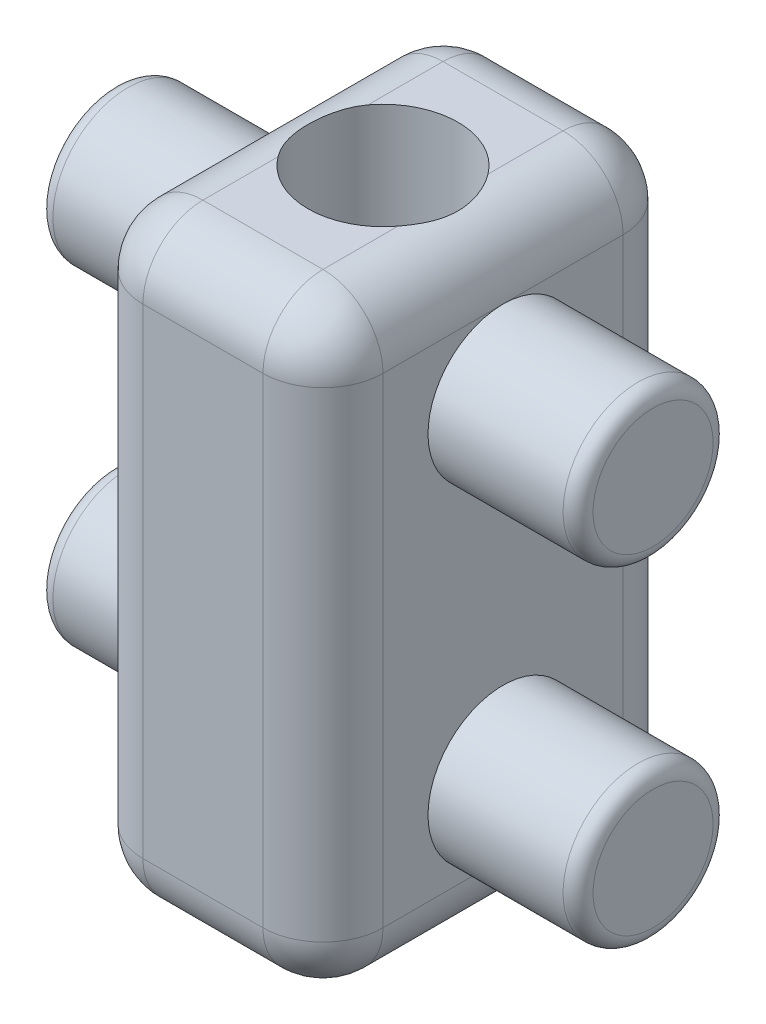
ISO-10303-21;
HEADER;
FILE_DESCRIPTION(('STEP AP214'),'2;1');
FILE_NAME('part.step','',(''),(''),'','','');
FILE_SCHEMA(('AUTOMOTIVE_DESIGN { 1 0 10303 214 1 1 1 1 }'));
ENDSEC;
DATA;
#1=APPLICATION_CONTEXT('core data for automotive mechanical design processes');
#2=APPLICATION_PROTOCOL_DEFINITION('international standard','automotive_design',2000,#1);
#3=PRODUCT_CONTEXT('',#1,'mechanical');
#4=PRODUCT('Part','Part','',(#3));
#5=PRODUCT_RELATED_PRODUCT_CATEGORY('part','',(#4));
#6=PRODUCT_DEFINITION_FORMATION('','',#4);
#7=PRODUCT_DEFINITION_CONTEXT('part definition',#1,'design');
#8=PRODUCT_DEFINITION('design','',#6,#7);
#9=PRODUCT_DEFINITION_SHAPE('','',#8);
#10=(LENGTH_UNIT() NAMED_UNIT(*) SI_UNIT(.MILLI.,.METRE.));
#11=(NAMED_UNIT(*) PLANE_ANGLE_UNIT() SI_UNIT($,.RADIAN.));
#12=(NAMED_UNIT(*) SI_UNIT($,.STERADIAN.) SOLID_ANGLE_UNIT());
#13=UNCERTAINTY_MEASURE_WITH_UNIT(LENGTH_MEASURE(1.E-05),#10,'distance_accuracy_value','');
#14=(GEOMETRIC_REPRESENTATION_CONTEXT(3) GLOBAL_UNCERTAINTY_ASSIGNED_CONTEXT((#13)) GLOBAL_UNIT_ASSIGNED_CONTEXT((#10,
#11,#12)) REPRESENTATION_CONTEXT('',''));
#15=CARTESIAN_POINT('',(0.,0.,0.));
#16=DIRECTION('',(0.,0.,1.));
#17=DIRECTION('',(1.,0.,0.));
#18=AXIS2_PLACEMENT_3D('',#15,#16,#17);
#19=CARTESIAN_POINT('',(-11.43,12.7,-12.7));
#20=DIRECTION('',(0.,-1.,0.));
#21=DIRECTION('',(0.,0.,-1.));
#22=AXIS2_PLACEMENT_3D('',#19,#20,#21);
#23=PLANE('',#22);
#24=DIRECTION('',(0.,0.,1.));
#25=VECTOR('',#24,1.);
#26=CARTESIAN_POINT('',(2.54,12.7,7.62));
#27=LINE('',#26,#25);
#28=CARTESIAN_POINT('',(2.54,12.7,5.08));
#29=VERTEX_POINT('',#28);
#30=CARTESIAN_POINT('',(2.54,12.7,1.905));
#31=VERTEX_POINT('',#30);
#32=EDGE_CURVE('E156',#29,#31,#27,.F.);
#33=ORIENTED_EDGE('',*,*,#32,.T.);
#34=CARTESIAN_POINT('',(0.,12.7,0.));
#35=DIRECTION('',(0.,-1.,0.));
#36=DIRECTION('',(0.,0.,-1.));
#37=AXIS2_PLACEMENT_3D('',#34,#35,#36);
#38=CIRCLE('',#37,3.175);
#39=CARTESIAN_POINT('',(-2.54,12.7,1.905));
#40=VERTEX_POINT('',#39);
#41=EDGE_CURVE('E11',#31,#40,#38,.T.);
#42=ORIENTED_EDGE('',*,*,#41,.T.);
#43=DIRECTION('',(0.,0.,1.));
#44=VECTOR('',#43,1.);
#45=CARTESIAN_POINT('',(-2.54,12.7,7.62));
#46=LINE('',#45,#44);
#47=CARTESIAN_POINT('',(-2.54,12.7,5.08));
#48=VERTEX_POINT('',#47);
#49=EDGE_CURVE('E172',#40,#48,#46,.T.);
#50=ORIENTED_EDGE('',*,*,#49,.T.);
#51=DIRECTION('',(-1.,0.,0.));
#52=VECTOR('',#51,1.);
#53=CARTESIAN_POINT('',(5.08,12.7,5.08));
#54=LINE('',#53,#52);
#55=EDGE_CURVE('E162',#48,#29,#54,.F.);
#56=ORIENTED_EDGE('',*,*,#55,.T.);
#57=EDGE_LOOP('',(#33,#42,#50,#56));
#58=FACE_BOUND('',#57,.T.);
#59=ADVANCED_FACE('F34',(#58),#23,.F.);
#60=CARTESIAN_POINT('',(5.08,0.,0.));
#61=DIRECTION('',(-1.,0.,0.));
#62=DIRECTION('',(0.,0.,1.));
#63=AXIS2_PLACEMENT_3D('',#60,#61,#62);
#64=PLANE('',#63);
#65=DIRECTION('',(0.,0.,-1.));
#66=VECTOR('',#65,1.);
#67=CARTESIAN_POINT('',(5.08,-10.16,0.));
#68=LINE('',#67,#66);
#69=CARTESIAN_POINT('',(5.08,-10.16,5.08));
#70=VERTEX_POINT('',#69);
#71=CARTESIAN_POINT('',(5.08,-10.16,0.));
#72=VERTEX_POINT('',#71);
#73=EDGE_CURVE('E202',#70,#72,#68,.T.);
#74=ORIENTED_EDGE('',*,*,#73,.T.);
#75=CARTESIAN_POINT('',(5.08,-6.985,0.));
#76=DIRECTION('',(1.,0.,0.));
#77=DIRECTION('',(0.,0.,-1.));
#78=AXIS2_PLACEMENT_3D('',#75,#76,#77);
#79=CIRCLE('',#78,3.175);
#80=EDGE_CURVE('E754',#72,#72,#79,.T.);
#81=ORIENTED_EDGE('',*,*,#80,.F.);
#82=CARTESIAN_POINT('',(5.08,-10.16,-5.08));
#83=VERTEX_POINT('',#82);
#84=EDGE_CURVE('E201',#72,#83,#68,.T.);
#85=ORIENTED_EDGE('',*,*,#84,.T.);
#86=DIRECTION('',(0.,1.,0.));
#87=VECTOR('',#86,1.);
#88=CARTESIAN_POINT('',(5.08,0.,-5.08));
#89=LINE('',#88,#87);
#90=CARTESIAN_POINT('',(5.08,10.16,-5.08));
#91=VERTEX_POINT('',#90);
#92=EDGE_CURVE('E195',#83,#91,#89,.T.);
#93=ORIENTED_EDGE('',*,*,#92,.T.);
#94=DIRECTION('',(0.,0.,1.));
#95=VECTOR('',#94,1.);
#96=CARTESIAN_POINT('',(5.08,10.16,0.));
#97=LINE('',#96,#95);
#98=CARTESIAN_POINT('',(5.08,10.16,0.));
#99=VERTEX_POINT('',#98);
#100=EDGE_CURVE('E198',#91,#99,#97,.T.);
#101=ORIENTED_EDGE('',*,*,#100,.T.);
#102=CARTESIAN_POINT('',(5.08,6.985,0.));
#103=DIRECTION('',(1.,0.,0.));
#104=DIRECTION('',(0.,0.,-1.));
#105=AXIS2_PLACEMENT_3D('',#102,#103,#104);
#106=CIRCLE('',#105,3.175);
#107=EDGE_CURVE('E208',#99,#99,#106,.T.);
#108=ORIENTED_EDGE('',*,*,#107,.F.);
#109=CARTESIAN_POINT('',(5.08,10.16,5.08));
#110=VERTEX_POINT('',#109);
#111=EDGE_CURVE('E197',#99,#110,#97,.T.);
#112=ORIENTED_EDGE('',*,*,#111,.T.);
#113=DIRECTION('',(0.,-1.,0.));
#114=VECTOR('',#113,1.);
#115=CARTESIAN_POINT('',(5.08,0.,5.08));
#116=LINE('',#115,#114);
#117=EDGE_CURVE('E57',#110,#70,#116,.T.);
#118=ORIENTED_EDGE('',*,*,#117,.T.);
#119=EDGE_LOOP('',(#74,#81,#85,#93,#101,#108,#112,#118));
#120=FACE_BOUND('',#119,.T.);
#121=ADVANCED_FACE('F364',(#120),#64,.F.);
#122=CARTESIAN_POINT('',(5.08,-12.7,-7.62));
#123=DIRECTION('',(0.,0.,1.));
#124=DIRECTION('',(1.,0.,0.));
#125=AXIS2_PLACEMENT_3D('',#122,#123,#124);
#126=PLANE('',#125);
#127=DIRECTION('',(-1.,0.,0.));
#128=VECTOR('',#127,1.);
#129=CARTESIAN_POINT('',(5.08,-10.16,-7.62));
#130=LINE('',#129,#128);
#131=CARTESIAN_POINT('',(2.54,-10.16,-7.62));
#132=VERTEX_POINT('',#131);
#133=CARTESIAN_POINT('',(-2.54,-10.16,-7.62));
#134=VERTEX_POINT('',#133);
#135=EDGE_CURVE('E764',#132,#134,#130,.T.);
#136=ORIENTED_EDGE('',*,*,#135,.T.);
#137=DIRECTION('',(0.,1.,0.));
#138=VECTOR('',#137,1.);
#139=CARTESIAN_POINT('',(-2.54,12.7,-7.62));
#140=LINE('',#139,#138);
#141=CARTESIAN_POINT('',(-2.54,10.16,-7.62));
#142=VERTEX_POINT('',#141);
#143=EDGE_CURVE('E767',#134,#142,#140,.T.);
#144=ORIENTED_EDGE('',*,*,#143,.T.);
#145=DIRECTION('',(-1.,0.,0.));
#146=VECTOR('',#145,1.);
#147=CARTESIAN_POINT('',(5.08,10.16,-7.62));
#148=LINE('',#147,#146);
#149=CARTESIAN_POINT('',(2.54,10.16,-7.62));
#150=VERTEX_POINT('',#149);
#151=EDGE_CURVE('E762',#142,#150,#148,.F.);
#152=ORIENTED_EDGE('',*,*,#151,.T.);
#153=DIRECTION('',(0.,1.,0.));
#154=VECTOR('',#153,1.);
#155=CARTESIAN_POINT('',(2.54,-12.7,-7.62));
#156=LINE('',#155,#154);
#157=EDGE_CURVE('E275',#150,#132,#156,.F.);
#158=ORIENTED_EDGE('',*,*,#157,.T.);
#159=EDGE_LOOP('',(#136,#144,#152,#158));
#160=FACE_BOUND('',#159,.T.);
#161=ADVANCED_FACE('F367',(#160),#126,.F.);
#162=CARTESIAN_POINT('',(5.08,-12.7,7.62));
#163=DIRECTION('',(0.,0.,-1.));
#164=DIRECTION('',(-1.,0.,0.));
#165=AXIS2_PLACEMENT_3D('',#162,#163,#164);
#166=PLANE('',#165);
#167=DIRECTION('',(-1.,0.,0.));
#168=VECTOR('',#167,1.);
#169=CARTESIAN_POINT('',(5.08,10.16,7.62));
#170=LINE('',#169,#168);
#171=CARTESIAN_POINT('',(2.54,10.16,7.62));
#172=VERTEX_POINT('',#171);
#173=CARTESIAN_POINT('',(-2.54,10.16,7.62));
#174=VERTEX_POINT('',#173);
#175=EDGE_CURVE('E180',#172,#174,#170,.T.);
#176=ORIENTED_EDGE('',*,*,#175,.T.);
#177=DIRECTION('',(0.,-1.,0.));
#178=VECTOR('',#177,1.);
#179=CARTESIAN_POINT('',(-2.54,-12.7,7.62));
#180=LINE('',#179,#178);
#181=CARTESIAN_POINT('',(-2.54,-10.16,7.62));
#182=VERTEX_POINT('',#181);
#183=EDGE_CURVE('E183',#174,#182,#180,.T.);
#184=ORIENTED_EDGE('',*,*,#183,.T.);
#185=DIRECTION('',(-1.,0.,0.));
#186=VECTOR('',#185,1.);
#187=CARTESIAN_POINT('',(5.08,-10.16,7.62));
#188=LINE('',#187,#186);
#189=CARTESIAN_POINT('',(2.54,-10.16,7.62));
#190=VERTEX_POINT('',#189);
#191=EDGE_CURVE('E178',#182,#190,#188,.F.);
#192=ORIENTED_EDGE('',*,*,#191,.T.);
#193=DIRECTION('',(0.,-1.,0.));
#194=VECTOR('',#193,1.);
#195=CARTESIAN_POINT('',(2.54,-12.7,7.62));
#196=LINE('',#195,#194);
#197=EDGE_CURVE('E176',#190,#172,#196,.F.);
#198=ORIENTED_EDGE('',*,*,#197,.T.);
#199=EDGE_LOOP('',(#176,#184,#192,#198));
#200=FACE_BOUND('',#199,.T.);
#201=ADVANCED_FACE('F376',(#200),#166,.F.);
#202=CARTESIAN_POINT('',(5.08,-12.7,7.62));
#203=DIRECTION('',(0.,1.,0.));
#204=DIRECTION('',(0.,0.,1.));
#205=AXIS2_PLACEMENT_3D('',#202,#203,#204);
#206=PLANE('',#205);
#207=DIRECTION('',(-1.,0.,0.));
#208=VECTOR('',#207,1.);
#209=CARTESIAN_POINT('',(5.08,-12.7,5.08));
#210=LINE('',#209,#208);
#211=CARTESIAN_POINT('',(2.54,-12.7,5.08));
#212=VERTEX_POINT('',#211);
#213=CARTESIAN_POINT('',(-2.54,-12.7,5.08));
#214=VERTEX_POINT('',#213);
#215=EDGE_CURVE('E771',#212,#214,#210,.T.);
#216=ORIENTED_EDGE('',*,*,#215,.T.);
#217=DIRECTION('',(0.,0.,-1.));
#218=VECTOR('',#217,1.);
#219=CARTESIAN_POINT('',(-2.54,-12.7,-7.62));
#220=LINE('',#219,#218);
#221=CARTESIAN_POINT('',(-2.54,-12.7,-5.08));
#222=VERTEX_POINT('',#221);
#223=EDGE_CURVE('E167',#214,#222,#220,.T.);
#224=ORIENTED_EDGE('',*,*,#223,.T.);
#225=DIRECTION('',(-1.,0.,0.));
#226=VECTOR('',#225,1.);
#227=CARTESIAN_POINT('',(5.08,-12.7,-5.08));
#228=LINE('',#227,#226);
#229=CARTESIAN_POINT('',(2.54,-12.7,-5.08));
#230=VERTEX_POINT('',#229);
#231=EDGE_CURVE('E772',#222,#230,#228,.F.);
#232=ORIENTED_EDGE('',*,*,#231,.T.);
#233=DIRECTION('',(0.,0.,-1.));
#234=VECTOR('',#233,1.);
#235=CARTESIAN_POINT('',(2.54,-12.7,7.62));
#236=LINE('',#235,#234);
#237=EDGE_CURVE('E769',#230,#212,#236,.F.);
#238=ORIENTED_EDGE('',*,*,#237,.T.);
#239=EDGE_LOOP('',(#216,#224,#232,#238));
#240=FACE_BOUND('',#239,.T.);
#241=ADVANCED_FACE('F372',(#240),#206,.F.);
#242=CARTESIAN_POINT('',(-5.08,0.,0.));
#243=DIRECTION('',(-1.,0.,0.));
#244=DIRECTION('',(0.,0.,1.));
#245=AXIS2_PLACEMENT_3D('',#242,#243,#244);
#246=PLANE('',#245);
#247=DIRECTION('',(0.,0.,-1.));
#248=VECTOR('',#247,1.);
#249=CARTESIAN_POINT('',(-5.08,-10.16,7.62));
#250=LINE('',#249,#248);
#251=CARTESIAN_POINT('',(-5.08,-10.16,-5.08));
#252=VERTEX_POINT('',#251);
#253=CARTESIAN_POINT('',(-5.08,-10.16,0.));
#254=VERTEX_POINT('',#253);
#255=EDGE_CURVE('E188',#252,#254,#250,.F.);
#256=ORIENTED_EDGE('',*,*,#255,.T.);
#257=CARTESIAN_POINT('',(-5.08,-6.985,0.));
#258=DIRECTION('',(1.,0.,0.));
#259=DIRECTION('',(0.,0.,-1.));
#260=AXIS2_PLACEMENT_3D('',#257,#258,#259);
#261=CIRCLE('',#260,3.175);
#262=EDGE_CURVE('E159',#254,#254,#261,.T.);
#263=ORIENTED_EDGE('',*,*,#262,.T.);
#264=CARTESIAN_POINT('',(-5.08,-10.16,5.08));
#265=VERTEX_POINT('',#264);
#266=EDGE_CURVE('E187',#254,#265,#250,.F.);
#267=ORIENTED_EDGE('',*,*,#266,.T.);
#268=DIRECTION('',(0.,-1.,0.));
#269=VECTOR('',#268,1.);
#270=CARTESIAN_POINT('',(-5.08,12.7,5.08));
#271=LINE('',#270,#269);
#272=CARTESIAN_POINT('',(-5.08,10.16,5.08));
#273=VERTEX_POINT('',#272);
#274=EDGE_CURVE('E190',#265,#273,#271,.F.);
#275=ORIENTED_EDGE('',*,*,#274,.T.);
#276=DIRECTION('',(0.,0.,1.));
#277=VECTOR('',#276,1.);
#278=CARTESIAN_POINT('',(-5.08,10.16,-7.62));
#279=LINE('',#278,#277);
#280=CARTESIAN_POINT('',(-5.08,10.16,0.));
#281=VERTEX_POINT('',#280);
#282=EDGE_CURVE('E193',#273,#281,#279,.F.);
#283=ORIENTED_EDGE('',*,*,#282,.T.);
#284=CARTESIAN_POINT('',(-5.08,6.985,0.));
#285=DIRECTION('',(1.,0.,0.));
#286=DIRECTION('',(0.,0.,-1.));
#287=AXIS2_PLACEMENT_3D('',#284,#285,#286);
#288=CIRCLE('',#287,3.175);
#289=EDGE_CURVE('E752',#281,#281,#288,.T.);
#290=ORIENTED_EDGE('',*,*,#289,.T.);
#291=CARTESIAN_POINT('',(-5.08,10.16,-5.08));
#292=VERTEX_POINT('',#291);
#293=EDGE_CURVE('E192',#281,#292,#279,.F.);
#294=ORIENTED_EDGE('',*,*,#293,.T.);
#295=DIRECTION('',(0.,1.,0.));
#296=VECTOR('',#295,1.);
#297=CARTESIAN_POINT('',(-5.08,-12.7,-5.08));
#298=LINE('',#297,#296);
#299=EDGE_CURVE('E185',#292,#252,#298,.F.);
#300=ORIENTED_EDGE('',*,*,#299,.T.);
#301=EDGE_LOOP('',(#256,#263,#267,#275,#283,#290,#294,#300));
#302=FACE_BOUND('',#301,.T.);
#303=ADVANCED_FACE('F368',(#302),#246,.T.);
#304=CARTESIAN_POINT('',(5.08,10.16,5.08));
#305=DIRECTION('',(-1.,0.,0.));
#306=DIRECTION('',(0.,0.,1.));
#307=AXIS2_PLACEMENT_3D('',#304,#305,#306);
#308=CYLINDRICAL_SURFACE('',#307,2.54);
#309=CARTESIAN_POINT('',(2.54,10.16,5.08));
#310=DIRECTION('',(1.,0.,0.));
#311=DIRECTION('',(0.,0.,-1.));
#312=AXIS2_PLACEMENT_3D('',#309,#310,#311);
#313=CIRCLE('',#312,2.54);
#314=EDGE_CURVE('E272',#29,#172,#313,.T.);
#315=ORIENTED_EDGE('',*,*,#314,.F.);
#316=ORIENTED_EDGE('',*,*,#55,.F.);
#317=CARTESIAN_POINT('',(-2.54,10.16,5.08));
#318=DIRECTION('',(-1.,0.,0.));
#319=DIRECTION('',(0.,0.,1.));
#320=AXIS2_PLACEMENT_3D('',#317,#318,#319);
#321=CIRCLE('',#320,2.54);
#322=EDGE_CURVE('E269',#174,#48,#321,.T.);
#323=ORIENTED_EDGE('',*,*,#322,.F.);
#324=ORIENTED_EDGE('',*,*,#175,.F.);
#325=EDGE_LOOP('',(#315,#316,#323,#324));
#326=FACE_BOUND('',#325,.T.);
#327=ADVANCED_FACE('F371',(#326),#308,.T.);
#328=CARTESIAN_POINT('',(2.54,10.16,5.08));
#329=DIRECTION('',(0.,0.,1.));
#330=DIRECTION('',(1.,0.,0.));
#331=AXIS2_PLACEMENT_3D('',#328,#329,#330);
#332=SPHERICAL_SURFACE('',#331,2.54);
#333=CARTESIAN_POINT('',(2.54,10.16,5.08));
#334=DIRECTION('',(0.,0.,1.));
#335=DIRECTION('',(1.,0.,0.));
#336=AXIS2_PLACEMENT_3D('',#333,#334,#335);
#337=CIRCLE('',#336,2.54);
#338=EDGE_CURVE('E264',#29,#110,#337,.F.);
#339=ORIENTED_EDGE('',*,*,#338,.F.);
#340=ORIENTED_EDGE('',*,*,#314,.T.);
#341=CARTESIAN_POINT('',(2.54,10.16,5.08));
#342=DIRECTION('',(0.,1.,0.));
#343=DIRECTION('',(0.,0.,1.));
#344=AXIS2_PLACEMENT_3D('',#341,#342,#343);
#345=CIRCLE('',#344,2.54);
#346=EDGE_CURVE('E266',#110,#172,#345,.F.);
#347=ORIENTED_EDGE('',*,*,#346,.F.);
#348=EDGE_LOOP('',(#339,#340,#347));
#349=FACE_BOUND('',#348,.T.);
#350=ADVANCED_FACE('F469',(#349),#332,.T.);
#351=CARTESIAN_POINT('',(-2.54,10.16,5.08));
#352=DIRECTION('',(0.,0.,1.));
#353=DIRECTION('',(1.,0.,0.));
#354=AXIS2_PLACEMENT_3D('',#351,#352,#353);
#355=SPHERICAL_SURFACE('',#354,2.54);
#356=CARTESIAN_POINT('',(-2.54,10.16,5.08));
#357=DIRECTION('',(0.,1.,0.));
#358=DIRECTION('',(0.,0.,1.));
#359=AXIS2_PLACEMENT_3D('',#356,#357,#358);
#360=CIRCLE('',#359,2.54);
#361=EDGE_CURVE('E258',#174,#273,#360,.F.);
#362=ORIENTED_EDGE('',*,*,#361,.F.);
#363=ORIENTED_EDGE('',*,*,#322,.T.);
#364=CARTESIAN_POINT('',(-2.54,10.16,5.08));
#365=DIRECTION('',(0.,0.,1.));
#366=DIRECTION('',(1.,0.,0.));
#367=AXIS2_PLACEMENT_3D('',#364,#365,#366);
#368=CIRCLE('',#367,2.54);
#369=EDGE_CURVE('E261',#273,#48,#368,.F.);
#370=ORIENTED_EDGE('',*,*,#369,.F.);
#371=EDGE_LOOP('',(#362,#363,#370));
#372=FACE_BOUND('',#371,.T.);
#373=ADVANCED_FACE('F478',(#372),#355,.T.);
#374=CARTESIAN_POINT('',(2.54,0.,5.08));
#375=DIRECTION('',(0.,-1.,0.));
#376=DIRECTION('',(0.,0.,-1.));
#377=AXIS2_PLACEMENT_3D('',#374,#375,#376);
#378=CYLINDRICAL_SURFACE('',#377,2.54);
#379=ORIENTED_EDGE('',*,*,#346,.T.);
#380=ORIENTED_EDGE('',*,*,#197,.F.);
#381=CARTESIAN_POINT('',(2.54,-10.16,5.08));
#382=DIRECTION('',(0.,-1.,0.));
#383=DIRECTION('',(0.,0.,-1.));
#384=AXIS2_PLACEMENT_3D('',#381,#382,#383);
#385=CIRCLE('',#384,2.54);
#386=EDGE_CURVE('E252',#70,#190,#385,.T.);
#387=ORIENTED_EDGE('',*,*,#386,.F.);
#388=ORIENTED_EDGE('',*,*,#117,.F.);
#389=EDGE_LOOP('',(#379,#380,#387,#388));
#390=FACE_BOUND('',#389,.T.);
#391=ADVANCED_FACE('F486',(#390),#378,.T.);
#392=CARTESIAN_POINT('',(2.54,10.16,0.));
#393=DIRECTION('',(0.,0.,1.));
#394=DIRECTION('',(1.,0.,0.));
#395=AXIS2_PLACEMENT_3D('',#392,#393,#394);
#396=CYLINDRICAL_SURFACE('',#395,2.54);
#397=CARTESIAN_POINT('',(2.54,12.7,1.905));
#398=CARTESIAN_POINT('',(2.5930144747761,12.6999862252163,1.83433008024039));
#399=CARTESIAN_POINT('',(2.64304418780027,12.6983400949674,1.76146316158012));
#400=CARTESIAN_POINT('',(2.73681256754995,12.6928023717573,1.61190923242004));
#401=CARTESIAN_POINT('',(2.78055403974719,12.6889117840593,1.5352239461572));
#402=CARTESIAN_POINT('',(2.86150406932594,12.6798990340502,1.37848165114559));
#403=CARTESIAN_POINT('',(2.89870748689939,12.6747759102249,1.29842205047689));
#404=CARTESIAN_POINT('',(2.96631988606513,12.6642012790137,1.13549535037719));
#405=CARTESIAN_POINT('',(2.99672819686997,12.6587497392752,1.05262797470223));
#406=CARTESIAN_POINT('',(3.05054069604224,12.6483126113036,0.88464818978456));
#407=CARTESIAN_POINT('',(3.0739470624711,12.6433268785069,0.799536487656744));
#408=CARTESIAN_POINT('',(3.1136022125579,12.6344684587865,0.627605400580466));
#409=CARTESIAN_POINT('',(3.12985126443965,12.6305957301544,0.540786079753235));
#410=CARTESIAN_POINT('',(3.15504934782979,12.624443734051,0.366145178129403));
#411=CARTESIAN_POINT('',(3.16400731259552,12.6221625171033,0.278324957914515));
#412=CARTESIAN_POINT('',(3.17458002225839,12.6194589557401,0.102214919682188));
#413=CARTESIAN_POINT('',(3.17619487430703,12.6190365842002,0.0139251085358922));
#414=CARTESIAN_POINT('',(3.17208089299991,12.6200971385345,-0.161895069374409));
#415=CARTESIAN_POINT('',(3.16639983447211,12.6215676695157,-0.249426636477158));
#416=CARTESIAN_POINT('',(3.14782483185976,12.6262198130967,-0.423675780026822));
#417=CARTESIAN_POINT('',(3.13493069870951,12.6294014705478,-0.510393335076655));
#418=CARTESIAN_POINT('',(3.10201816982114,12.6370992435227,-0.682489232509958));
#419=CARTESIAN_POINT('',(3.08199288994507,12.6416166478083,-0.767866197293173));
#420=CARTESIAN_POINT('',(3.03496640143451,12.6514222048976,-0.936630510721468));
#421=CARTESIAN_POINT('',(3.00796532716197,12.6567103428551,-1.02001789765435));
#422=CARTESIAN_POINT('',(2.95102683913863,12.6666673723006,-1.17384523842122));
#423=CARTESIAN_POINT('',(2.92189644299456,12.6713297189628,-1.24458573482167));
#424=CARTESIAN_POINT('',(2.85859769024736,12.68014203093,-1.3837954353501));
#425=CARTESIAN_POINT('',(2.82443031366766,12.6842920956194,-1.45226507814085));
#426=CARTESIAN_POINT('',(2.75126299343156,12.6914658240478,-1.58650838612093));
#427=CARTESIAN_POINT('',(2.71227019344552,12.6944911269402,-1.65228584922509));
#428=CARTESIAN_POINT('',(2.62959767281221,12.6987548964392,-1.78092659831066));
#429=CARTESIAN_POINT('',(2.5859157945231,12.6999925366479,-1.84378852351398));
#430=CARTESIAN_POINT('',(2.54,12.7,-1.905));
#431=B_SPLINE_CURVE_WITH_KNOTS('',3,(#397,#398,#399,#400,#401,#402,#403,#404,#405,#406,#407,
#408,#409,#410,#411,#412,#413,#414,#415,#416,#417,#418,#419,#420,#421,#422,#423,#424,#425,#426,
#427,#428,#429,#430),.UNSPECIFIED.,.F.,.F.,(4,2,2,2,2,2,2,2,2,2,2,2,2,2,2,2,4),(0.,
0.26489527949035,0.529672007856606,0.794655964885841,1.05966606859315,1.32459365094662,
1.58951130416678,1.85410388168812,2.1186925982337,2.38155754601834,2.64442938421755,
2.90755567990787,3.17067690785609,3.40041930587477,3.63011706276295,3.85947874883193,
4.08894642994839),.UNSPECIFIED.);
#432=CARTESIAN_POINT('',(2.54,12.7,-1.905));
#433=VERTEX_POINT('',#432);
#434=EDGE_CURVE('E49',#31,#433,#431,.T.);
#435=ORIENTED_EDGE('',*,*,#434,.F.);
#436=ORIENTED_EDGE('',*,*,#32,.F.);
#437=ORIENTED_EDGE('',*,*,#338,.T.);
#438=ORIENTED_EDGE('',*,*,#111,.F.);
#439=ORIENTED_EDGE('',*,*,#100,.F.);
#440=CARTESIAN_POINT('',(2.54,10.16,-5.08));
#441=DIRECTION('',(0.,0.,-1.));
#442=DIRECTION('',(-1.,0.,0.));
#443=AXIS2_PLACEMENT_3D('',#440,#441,#442);
#444=CIRCLE('',#443,2.54);
#445=CARTESIAN_POINT('',(2.54,12.7,-5.08));
#446=VERTEX_POINT('',#445);
#447=EDGE_CURVE('E249',#446,#91,#444,.T.);
#448=ORIENTED_EDGE('',*,*,#447,.F.);
#449=EDGE_CURVE('E158',#433,#446,#27,.F.);
#450=ORIENTED_EDGE('',*,*,#449,.F.);
#451=EDGE_LOOP('',(#435,#436,#437,#438,#439,#448,#450));
#452=FACE_BOUND('',#451,.T.);
#453=ADVANCED_FACE('F154',(#452),#396,.T.);
#454=CARTESIAN_POINT('',(5.08,10.16,-5.08));
#455=DIRECTION('',(-1.,0.,0.));
#456=DIRECTION('',(0.,0.,1.));
#457=AXIS2_PLACEMENT_3D('',#454,#455,#456);
#458=CYLINDRICAL_SURFACE('',#457,2.54);
#459=CARTESIAN_POINT('',(-2.54,10.16,-5.08));
#460=DIRECTION('',(-1.,0.,0.));
#461=DIRECTION('',(0.,0.,1.));
#462=AXIS2_PLACEMENT_3D('',#459,#460,#461);
#463=CIRCLE('',#462,2.54);
#464=CARTESIAN_POINT('',(-2.54,12.7,-5.08));
#465=VERTEX_POINT('',#464);
#466=EDGE_CURVE('E243',#465,#142,#463,.T.);
#467=ORIENTED_EDGE('',*,*,#466,.F.);
#468=DIRECTION('',(-1.,0.,0.));
#469=VECTOR('',#468,1.);
#470=CARTESIAN_POINT('',(5.08,12.7,-5.08));
#471=LINE('',#470,#469);
#472=EDGE_CURVE('E165',#446,#465,#471,.T.);
#473=ORIENTED_EDGE('',*,*,#472,.F.);
#474=CARTESIAN_POINT('',(2.54,10.16,-5.08));
#475=DIRECTION('',(1.,0.,0.));
#476=DIRECTION('',(0.,0.,-1.));
#477=AXIS2_PLACEMENT_3D('',#474,#475,#476);
#478=CIRCLE('',#477,2.54);
#479=EDGE_CURVE('E246',#150,#446,#478,.T.);
#480=ORIENTED_EDGE('',*,*,#479,.F.);
#481=ORIENTED_EDGE('',*,*,#151,.F.);
#482=EDGE_LOOP('',(#467,#473,#480,#481));
#483=FACE_BOUND('',#482,.T.);
#484=ADVANCED_FACE('F436',(#483),#458,.T.);
#485=CARTESIAN_POINT('',(-2.54,10.16,7.62));
#486=DIRECTION('',(0.,0.,-1.));
#487=DIRECTION('',(-1.,0.,0.));
#488=AXIS2_PLACEMENT_3D('',#485,#486,#487);
#489=CYLINDRICAL_SURFACE('',#488,2.54);
#490=CARTESIAN_POINT('',(-2.54,12.7,-1.905));
#491=CARTESIAN_POINT('',(-2.5930144747761,12.6999862252163,-1.83433008024039));
#492=CARTESIAN_POINT('',(-2.64304418780027,12.6983400949674,-1.76146316158012));
#493=CARTESIAN_POINT('',(-2.73681256754995,12.6928023717573,-1.61190923242004));
#494=CARTESIAN_POINT('',(-2.78055403974719,12.6889117840593,-1.53522394615721));
#495=CARTESIAN_POINT('',(-2.86150406932594,12.6798990340502,-1.37848165114559));
#496=CARTESIAN_POINT('',(-2.89870748689939,12.6747759102249,-1.29842205047689));
#497=CARTESIAN_POINT('',(-2.96631988606513,12.6642012790137,-1.13549535037719));
#498=CARTESIAN_POINT('',(-2.99672819686997,12.6587497392752,-1.05262797470223));
#499=CARTESIAN_POINT('',(-3.05054069604224,12.6483126113036,-0.884648189784562));
#500=CARTESIAN_POINT('',(-3.0739470624711,12.6433268785069,-0.799536487656746));
#501=CARTESIAN_POINT('',(-3.1136022125579,12.6344684587865,-0.627605400580467));
#502=CARTESIAN_POINT('',(-3.12985126443965,12.6305957301544,-0.540786079753237));
#503=CARTESIAN_POINT('',(-3.15504934782979,12.624443734051,-0.366145178129405));
#504=CARTESIAN_POINT('',(-3.16400731259552,12.6221625171033,-0.278324957914517));
#505=CARTESIAN_POINT('',(-3.17458002225839,12.6194589557401,-0.10221491968219));
#506=CARTESIAN_POINT('',(-3.17619487430703,12.6190365842002,-0.0139251085358941));
#507=CARTESIAN_POINT('',(-3.17208089299991,12.6200971385345,0.161895069374407));
#508=CARTESIAN_POINT('',(-3.16639983447211,12.6215676695157,0.249426636477156));
#509=CARTESIAN_POINT('',(-3.14782483185976,12.6262198130967,0.42367578002682));
#510=CARTESIAN_POINT('',(-3.13493069870951,12.6294014705478,0.510393335076653));
#511=CARTESIAN_POINT('',(-3.10201816982114,12.6370992435227,0.682489232509956));
#512=CARTESIAN_POINT('',(-3.08199288994507,12.6416166478083,0.767866197293171));
#513=CARTESIAN_POINT('',(-3.03496640143451,12.6514222048976,0.936630510721466));
#514=CARTESIAN_POINT('',(-3.00796532716197,12.6567103428551,1.02001789765435));
#515=CARTESIAN_POINT('',(-2.95102683913863,12.6666673723006,1.17384523842122));
#516=CARTESIAN_POINT('',(-2.92189644299456,12.6713297189628,1.24458573482167));
#517=CARTESIAN_POINT('',(-2.85859769024736,12.68014203093,1.3837954353501));
#518=CARTESIAN_POINT('',(-2.82443031366766,12.6842920956194,1.45226507814085));
#519=CARTESIAN_POINT('',(-2.75126299343156,12.6914658240478,1.58650838612093));
#520=CARTESIAN_POINT('',(-2.71227019344552,12.6944911269402,1.65228584922509));
#521=CARTESIAN_POINT('',(-2.62959767281221,12.6987548964392,1.78092659831066));
#522=CARTESIAN_POINT('',(-2.5859157945231,12.6999925366479,1.84378852351398));
#523=CARTESIAN_POINT('',(-2.54,12.7,1.905));
#524=B_SPLINE_CURVE_WITH_KNOTS('',3,(#490,#491,#492,#493,#494,#495,#496,#497,#498,#499,#500,
#501,#502,#503,#504,#505,#506,#507,#508,#509,#510,#511,#512,#513,#514,#515,#516,#517,#518,#519,
#520,#521,#522,#523),.UNSPECIFIED.,.F.,.F.,(4,2,2,2,2,2,2,2,2,2,2,2,2,2,2,2,4),(0.,
0.26489527949035,0.529672007856606,0.794655964885841,1.05966606859315,1.32459365094662,
1.58951130416678,1.85410388168812,2.1186925982337,2.38155754601833,2.64442938421755,
2.90755567990787,3.17067690785609,3.40041930587477,3.63011706276295,3.85947874883193,
4.08894642994839),.UNSPECIFIED.);
#525=CARTESIAN_POINT('',(-2.54,12.7,-1.905));
#526=VERTEX_POINT('',#525);
#527=EDGE_CURVE('E147',#526,#40,#524,.T.);
#528=ORIENTED_EDGE('',*,*,#527,.F.);
#529=EDGE_CURVE('E173',#465,#526,#46,.T.);
#530=ORIENTED_EDGE('',*,*,#529,.F.);
#531=CARTESIAN_POINT('',(-2.54,10.16,-5.08));
#532=DIRECTION('',(0.,0.,-1.));
#533=DIRECTION('',(0.,1.,0.));
#534=AXIS2_PLACEMENT_3D('',#531,#532,#533);
#535=CIRCLE('',#534,2.54);
#536=EDGE_CURVE('E240',#292,#465,#535,.T.);
#537=ORIENTED_EDGE('',*,*,#536,.F.);
#538=ORIENTED_EDGE('',*,*,#293,.F.);
#539=ORIENTED_EDGE('',*,*,#282,.F.);
#540=ORIENTED_EDGE('',*,*,#369,.T.);
#541=ORIENTED_EDGE('',*,*,#49,.F.);
#542=EDGE_LOOP('',(#528,#530,#537,#538,#539,#540,#541));
#543=FACE_BOUND('',#542,.T.);
#544=ADVANCED_FACE('F304',(#543),#489,.T.);
#545=CARTESIAN_POINT('',(-2.54,-12.7,5.08));
#546=DIRECTION('',(0.,1.,0.));
#547=DIRECTION('',(0.,0.,1.));
#548=AXIS2_PLACEMENT_3D('',#545,#546,#547);
#549=CYLINDRICAL_SURFACE('',#548,2.54);
#550=ORIENTED_EDGE('',*,*,#361,.T.);
#551=ORIENTED_EDGE('',*,*,#274,.F.);
#552=CARTESIAN_POINT('',(-2.54,-10.16,5.08));
#553=DIRECTION('',(0.,-1.,0.));
#554=DIRECTION('',(0.,0.,-1.));
#555=AXIS2_PLACEMENT_3D('',#552,#553,#554);
#556=CIRCLE('',#555,2.54);
#557=EDGE_CURVE('E237',#182,#265,#556,.T.);
#558=ORIENTED_EDGE('',*,*,#557,.F.);
#559=ORIENTED_EDGE('',*,*,#183,.F.);
#560=EDGE_LOOP('',(#550,#551,#558,#559));
#561=FACE_BOUND('',#560,.T.);
#562=ADVANCED_FACE('F429',(#561),#549,.T.);
#563=CARTESIAN_POINT('',(5.08,-10.16,5.08));
#564=DIRECTION('',(-1.,0.,0.));
#565=DIRECTION('',(0.,0.,1.));
#566=AXIS2_PLACEMENT_3D('',#563,#564,#565);
#567=CYLINDRICAL_SURFACE('',#566,2.54);
#568=CARTESIAN_POINT('',(2.54,-10.16,5.08));
#569=DIRECTION('',(1.,0.,0.));
#570=DIRECTION('',(0.,0.,-1.));
#571=AXIS2_PLACEMENT_3D('',#568,#569,#570);
#572=CIRCLE('',#571,2.54);
#573=EDGE_CURVE('E255',#190,#212,#572,.T.);
#574=ORIENTED_EDGE('',*,*,#573,.F.);
#575=ORIENTED_EDGE('',*,*,#191,.F.);
#576=CARTESIAN_POINT('',(-2.54,-10.16,5.08));
#577=DIRECTION('',(-1.,0.,0.));
#578=DIRECTION('',(0.,0.,1.));
#579=AXIS2_PLACEMENT_3D('',#576,#577,#578);
#580=CIRCLE('',#579,2.54);
#581=EDGE_CURVE('E234',#214,#182,#580,.T.);
#582=ORIENTED_EDGE('',*,*,#581,.F.);
#583=ORIENTED_EDGE('',*,*,#215,.F.);
#584=EDGE_LOOP('',(#574,#575,#582,#583));
#585=FACE_BOUND('',#584,.T.);
#586=ADVANCED_FACE('F426',(#585),#567,.T.);
#587=CARTESIAN_POINT('',(2.54,-10.16,5.08));
#588=DIRECTION('',(0.,0.,1.));
#589=DIRECTION('',(1.,0.,0.));
#590=AXIS2_PLACEMENT_3D('',#587,#588,#589);
#591=SPHERICAL_SURFACE('',#590,2.54);
#592=ORIENTED_EDGE('',*,*,#386,.T.);
#593=ORIENTED_EDGE('',*,*,#573,.T.);
#594=CARTESIAN_POINT('',(2.54,-10.16,5.08));
#595=DIRECTION('',(0.,0.,1.));
#596=DIRECTION('',(1.,0.,0.));
#597=AXIS2_PLACEMENT_3D('',#594,#595,#596);
#598=CIRCLE('',#597,2.54);
#599=EDGE_CURVE('E231',#70,#212,#598,.F.);
#600=ORIENTED_EDGE('',*,*,#599,.F.);
#601=EDGE_LOOP('',(#592,#593,#600));
#602=FACE_BOUND('',#601,.T.);
#603=ADVANCED_FACE('F422',(#602),#591,.T.);
#604=CARTESIAN_POINT('',(2.54,10.16,-5.08));
#605=DIRECTION('',(0.,0.,1.));
#606=DIRECTION('',(1.,0.,0.));
#607=AXIS2_PLACEMENT_3D('',#604,#605,#606);
#608=SPHERICAL_SURFACE('',#607,2.54);
#609=ORIENTED_EDGE('',*,*,#479,.T.);
#610=ORIENTED_EDGE('',*,*,#447,.T.);
#611=CARTESIAN_POINT('',(2.54,10.16,-5.08));
#612=DIRECTION('',(0.,1.,0.));
#613=DIRECTION('',(0.,0.,1.));
#614=AXIS2_PLACEMENT_3D('',#611,#612,#613);
#615=CIRCLE('',#614,2.54);
#616=EDGE_CURVE('E228',#150,#91,#615,.F.);
#617=ORIENTED_EDGE('',*,*,#616,.F.);
#618=EDGE_LOOP('',(#609,#610,#617));
#619=FACE_BOUND('',#618,.T.);
#620=ADVANCED_FACE('F418',(#619),#608,.T.);
#621=CARTESIAN_POINT('',(-2.54,10.16,-5.08));
#622=DIRECTION('',(0.,0.,1.));
#623=DIRECTION('',(1.,0.,0.));
#624=AXIS2_PLACEMENT_3D('',#621,#622,#623);
#625=SPHERICAL_SURFACE('',#624,2.54);
#626=ORIENTED_EDGE('',*,*,#536,.T.);
#627=ORIENTED_EDGE('',*,*,#466,.T.);
#628=CARTESIAN_POINT('',(-2.54,10.16,-5.08));
#629=DIRECTION('',(0.,1.,0.));
#630=DIRECTION('',(0.,0.,1.));
#631=AXIS2_PLACEMENT_3D('',#628,#629,#630);
#632=CIRCLE('',#631,2.54);
#633=EDGE_CURVE('E225',#292,#142,#632,.F.);
#634=ORIENTED_EDGE('',*,*,#633,.F.);
#635=EDGE_LOOP('',(#626,#627,#634));
#636=FACE_BOUND('',#635,.T.);
#637=ADVANCED_FACE('F414',(#636),#625,.T.);
#638=CARTESIAN_POINT('',(-2.54,-10.16,5.08));
#639=DIRECTION('',(0.,0.,1.));
#640=DIRECTION('',(1.,0.,0.));
#641=AXIS2_PLACEMENT_3D('',#638,#639,#640);
#642=SPHERICAL_SURFACE('',#641,2.54);
#643=ORIENTED_EDGE('',*,*,#581,.T.);
#644=ORIENTED_EDGE('',*,*,#557,.T.);
#645=CARTESIAN_POINT('',(-2.54,-10.16,5.08));
#646=DIRECTION('',(0.,0.,1.));
#647=DIRECTION('',(1.,0.,0.));
#648=AXIS2_PLACEMENT_3D('',#645,#646,#647);
#649=CIRCLE('',#648,2.54);
#650=EDGE_CURVE('E222',#214,#265,#649,.F.);
#651=ORIENTED_EDGE('',*,*,#650,.F.);
#652=EDGE_LOOP('',(#643,#644,#651));
#653=FACE_BOUND('',#652,.T.);
#654=ADVANCED_FACE('F410',(#653),#642,.T.);
#655=CARTESIAN_POINT('',(2.54,-10.16,0.));
#656=DIRECTION('',(0.,0.,-1.));
#657=DIRECTION('',(-1.,0.,0.));
#658=AXIS2_PLACEMENT_3D('',#655,#656,#657);
#659=CYLINDRICAL_SURFACE('',#658,2.54);
#660=ORIENTED_EDGE('',*,*,#599,.T.);
#661=ORIENTED_EDGE('',*,*,#237,.F.);
#662=CARTESIAN_POINT('',(2.54,-10.16,-5.08));
#663=DIRECTION('',(0.,0.,-1.));
#664=DIRECTION('',(-1.,0.,0.));
#665=AXIS2_PLACEMENT_3D('',#662,#663,#664);
#666=CIRCLE('',#665,2.54);
#667=EDGE_CURVE('E219',#83,#230,#666,.T.);
#668=ORIENTED_EDGE('',*,*,#667,.F.);
#669=ORIENTED_EDGE('',*,*,#84,.F.);
#670=ORIENTED_EDGE('',*,*,#73,.F.);
#671=EDGE_LOOP('',(#660,#661,#668,#669,#670));
#672=FACE_BOUND('',#671,.T.);
#673=ADVANCED_FACE('F406',(#672),#659,.T.);
#674=CARTESIAN_POINT('',(2.54,0.,-5.08));
#675=DIRECTION('',(0.,1.,0.));
#676=DIRECTION('',(0.,0.,1.));
#677=AXIS2_PLACEMENT_3D('',#674,#675,#676);
#678=CYLINDRICAL_SURFACE('',#677,2.54);
#679=ORIENTED_EDGE('',*,*,#616,.T.);
#680=ORIENTED_EDGE('',*,*,#92,.F.);
#681=CARTESIAN_POINT('',(2.54,-10.16,-5.08));
#682=DIRECTION('',(0.,-1.,0.));
#683=DIRECTION('',(0.,0.,-1.));
#684=AXIS2_PLACEMENT_3D('',#681,#682,#683);
#685=CIRCLE('',#684,2.54);
#686=EDGE_CURVE('E216',#132,#83,#685,.T.);
#687=ORIENTED_EDGE('',*,*,#686,.F.);
#688=ORIENTED_EDGE('',*,*,#157,.F.);
#689=EDGE_LOOP('',(#679,#680,#687,#688));
#690=FACE_BOUND('',#689,.T.);
#691=ADVANCED_FACE('F402',(#690),#678,.T.);
#692=CARTESIAN_POINT('',(-2.54,-12.7,-5.08));
#693=DIRECTION('',(0.,-1.,0.));
#694=DIRECTION('',(0.,0.,-1.));
#695=AXIS2_PLACEMENT_3D('',#692,#693,#694);
#696=CYLINDRICAL_SURFACE('',#695,2.54);
#697=ORIENTED_EDGE('',*,*,#633,.T.);
#698=ORIENTED_EDGE('',*,*,#143,.F.);
#699=CARTESIAN_POINT('',(-2.54,-10.16,-5.08));
#700=DIRECTION('',(0.,-1.,0.));
#701=DIRECTION('',(0.,0.,-1.));
#702=AXIS2_PLACEMENT_3D('',#699,#700,#701);
#703=CIRCLE('',#702,2.54);
#704=EDGE_CURVE('E213',#252,#134,#703,.T.);
#705=ORIENTED_EDGE('',*,*,#704,.F.);
#706=ORIENTED_EDGE('',*,*,#299,.F.);
#707=EDGE_LOOP('',(#697,#698,#705,#706));
#708=FACE_BOUND('',#707,.T.);
#709=ADVANCED_FACE('F398',(#708),#696,.T.);
#710=CARTESIAN_POINT('',(-2.54,-10.16,7.62));
#711=DIRECTION('',(0.,0.,1.));
#712=DIRECTION('',(1.,0.,0.));
#713=AXIS2_PLACEMENT_3D('',#710,#711,#712);
#714=CYLINDRICAL_SURFACE('',#713,2.54);
#715=ORIENTED_EDGE('',*,*,#650,.T.);
#716=ORIENTED_EDGE('',*,*,#266,.F.);
#717=ORIENTED_EDGE('',*,*,#255,.F.);
#718=CARTESIAN_POINT('',(-2.54,-10.16,-5.08));
#719=DIRECTION('',(0.,0.,-1.));
#720=DIRECTION('',(-1.,0.,0.));
#721=AXIS2_PLACEMENT_3D('',#718,#719,#720);
#722=CIRCLE('',#721,2.54);
#723=EDGE_CURVE('E210',#222,#252,#722,.T.);
#724=ORIENTED_EDGE('',*,*,#723,.F.);
#725=ORIENTED_EDGE('',*,*,#223,.F.);
#726=EDGE_LOOP('',(#715,#716,#717,#724,#725));
#727=FACE_BOUND('',#726,.T.);
#728=ADVANCED_FACE('F394',(#727),#714,.T.);
#729=CARTESIAN_POINT('',(2.54,-10.16,-5.08));
#730=DIRECTION('',(0.,0.,1.));
#731=DIRECTION('',(1.,0.,0.));
#732=AXIS2_PLACEMENT_3D('',#729,#730,#731);
#733=SPHERICAL_SURFACE('',#732,2.54);
#734=ORIENTED_EDGE('',*,*,#686,.T.);
#735=ORIENTED_EDGE('',*,*,#667,.T.);
#736=CARTESIAN_POINT('',(2.54,-10.16,-5.08));
#737=DIRECTION('',(1.,0.,0.));
#738=DIRECTION('',(0.,0.,-1.));
#739=AXIS2_PLACEMENT_3D('',#736,#737,#738);
#740=CIRCLE('',#739,2.54);
#741=EDGE_CURVE('E207',#132,#230,#740,.F.);
#742=ORIENTED_EDGE('',*,*,#741,.F.);
#743=EDGE_LOOP('',(#734,#735,#742));
#744=FACE_BOUND('',#743,.T.);
#745=ADVANCED_FACE('F390',(#744),#733,.T.);
#746=CARTESIAN_POINT('',(-2.54,-10.16,-5.08));
#747=DIRECTION('',(0.,0.,1.));
#748=DIRECTION('',(1.,0.,0.));
#749=AXIS2_PLACEMENT_3D('',#746,#747,#748);
#750=SPHERICAL_SURFACE('',#749,2.54);
#751=ORIENTED_EDGE('',*,*,#723,.T.);
#752=ORIENTED_EDGE('',*,*,#704,.T.);
#753=CARTESIAN_POINT('',(-2.54,-10.16,-5.08));
#754=DIRECTION('',(-1.,0.,0.));
#755=DIRECTION('',(0.,0.,1.));
#756=AXIS2_PLACEMENT_3D('',#753,#754,#755);
#757=CIRCLE('',#756,2.54);
#758=EDGE_CURVE('E205',#222,#134,#757,.F.);
#759=ORIENTED_EDGE('',*,*,#758,.F.);
#760=EDGE_LOOP('',(#751,#752,#759));
#761=FACE_BOUND('',#760,.T.);
#762=ADVANCED_FACE('F386',(#761),#750,.T.);
#763=CARTESIAN_POINT('',(5.08,-10.16,-5.08));
#764=DIRECTION('',(-1.,0.,0.));
#765=DIRECTION('',(0.,0.,1.));
#766=AXIS2_PLACEMENT_3D('',#763,#764,#765);
#767=CYLINDRICAL_SURFACE('',#766,2.54);
#768=ORIENTED_EDGE('',*,*,#741,.T.);
#769=ORIENTED_EDGE('',*,*,#231,.F.);
#770=ORIENTED_EDGE('',*,*,#758,.T.);
#771=ORIENTED_EDGE('',*,*,#135,.F.);
#772=EDGE_LOOP('',(#768,#769,#770,#771));
#773=FACE_BOUND('',#772,.T.);
#774=ADVANCED_FACE('F363',(#773),#767,.T.);
#775=CARTESIAN_POINT('',(11.43,6.985,0.));
#776=DIRECTION('',(-1.,0.,0.));
#777=DIRECTION('',(0.,0.,1.));
#778=AXIS2_PLACEMENT_3D('',#775,#776,#777);
#779=CYLINDRICAL_SURFACE('',#778,3.175);
#780=CARTESIAN_POINT('',(10.795,6.985,0.));
#781=DIRECTION('',(1.,0.,0.));
#782=DIRECTION('',(0.,0.,-1.));
#783=AXIS2_PLACEMENT_3D('',#780,#781,#782);
#784=CIRCLE('',#783,3.175);
#785=CARTESIAN_POINT('',(10.795,6.985,-3.175));
#786=VERTEX_POINT('',#785);
#787=EDGE_CURVE('E295',#786,#786,#784,.F.);
#788=ORIENTED_EDGE('',*,*,#787,.T.);
#789=EDGE_LOOP('',(#788));
#790=FACE_BOUND('',#789,.T.);
#791=ORIENTED_EDGE('',*,*,#107,.T.);
#792=EDGE_LOOP('',(#791));
#793=FACE_BOUND('',#792,.T.);
#794=ADVANCED_FACE('F359',(#790,#793),#779,.T.);
#795=CARTESIAN_POINT('',(11.43,6.985,0.));
#796=DIRECTION('',(1.,0.,0.));
#797=DIRECTION('',(0.,0.,-1.));
#798=AXIS2_PLACEMENT_3D('',#795,#796,#797);
#799=PLANE('',#798);
#800=CARTESIAN_POINT('',(11.43,6.985,0.));
#801=DIRECTION('',(1.,0.,0.));
#802=DIRECTION('',(0.,0.,-1.));
#803=AXIS2_PLACEMENT_3D('',#800,#801,#802);
#804=CIRCLE('',#803,2.54);
#805=CARTESIAN_POINT('',(11.43,6.985,-2.54));
#806=VERTEX_POINT('',#805);
#807=EDGE_CURVE('E293',#806,#806,#804,.T.);
#808=ORIENTED_EDGE('',*,*,#807,.T.);
#809=EDGE_LOOP('',(#808));
#810=FACE_BOUND('',#809,.T.);
#811=ADVANCED_FACE('F355',(#810),#799,.T.);
#812=CARTESIAN_POINT('',(11.43,-6.985,0.));
#813=DIRECTION('',(-1.,0.,0.));
#814=DIRECTION('',(0.,0.,1.));
#815=AXIS2_PLACEMENT_3D('',#812,#813,#814);
#816=CYLINDRICAL_SURFACE('',#815,3.175);
#817=CARTESIAN_POINT('',(10.795,-6.985,0.));
#818=DIRECTION('',(1.,0.,0.));
#819=DIRECTION('',(0.,0.,-1.));
#820=AXIS2_PLACEMENT_3D('',#817,#818,#819);
#821=CIRCLE('',#820,3.175);
#822=CARTESIAN_POINT('',(10.795,-6.985,-3.175));
#823=VERTEX_POINT('',#822);
#824=EDGE_CURVE('E290',#823,#823,#821,.F.);
#825=ORIENTED_EDGE('',*,*,#824,.T.);
#826=EDGE_LOOP('',(#825));
#827=FACE_BOUND('',#826,.T.);
#828=ORIENTED_EDGE('',*,*,#80,.T.);
#829=EDGE_LOOP('',(#828));
#830=FACE_BOUND('',#829,.T.);
#831=ADVANCED_FACE('F351',(#827,#830),#816,.T.);
#832=CARTESIAN_POINT('',(11.43,-6.985,0.));
#833=DIRECTION('',(1.,0.,0.));
#834=DIRECTION('',(0.,0.,-1.));
#835=AXIS2_PLACEMENT_3D('',#832,#833,#834);
#836=PLANE('',#835);
#837=CARTESIAN_POINT('',(11.43,-6.985,0.));
#838=DIRECTION('',(1.,0.,0.));
#839=DIRECTION('',(0.,0.,-1.));
#840=AXIS2_PLACEMENT_3D('',#837,#838,#839);
#841=CIRCLE('',#840,2.54);
#842=CARTESIAN_POINT('',(11.43,-6.985,-2.54));
#843=VERTEX_POINT('',#842);
#844=EDGE_CURVE('E287',#843,#843,#841,.T.);
#845=ORIENTED_EDGE('',*,*,#844,.T.);
#846=EDGE_LOOP('',(#845));
#847=FACE_BOUND('',#846,.T.);
#848=ADVANCED_FACE('F347',(#847),#836,.T.);
#849=CARTESIAN_POINT('',(-11.43,6.985,0.));
#850=DIRECTION('',(1.,0.,0.));
#851=DIRECTION('',(0.,0.,-1.));
#852=AXIS2_PLACEMENT_3D('',#849,#850,#851);
#853=CYLINDRICAL_SURFACE('',#852,3.175);
#854=CARTESIAN_POINT('',(-10.795,6.985,0.));
#855=DIRECTION('',(-1.,0.,0.));
#856=DIRECTION('',(0.,0.,1.));
#857=AXIS2_PLACEMENT_3D('',#854,#855,#856);
#858=CIRCLE('',#857,3.175);
#859=CARTESIAN_POINT('',(-10.795,6.985,3.175));
#860=VERTEX_POINT('',#859);
#861=EDGE_CURVE('E281',#860,#860,#858,.F.);
#862=ORIENTED_EDGE('',*,*,#861,.T.);
#863=EDGE_LOOP('',(#862));
#864=FACE_BOUND('',#863,.T.);
#865=ORIENTED_EDGE('',*,*,#289,.F.);
#866=EDGE_LOOP('',(#865));
#867=FACE_BOUND('',#866,.T.);
#868=ADVANCED_FACE('F343',(#864,#867),#853,.T.);
#869=CARTESIAN_POINT('',(-11.43,6.985,0.));
#870=DIRECTION('',(-1.,0.,0.));
#871=DIRECTION('',(0.,0.,-1.));
#872=AXIS2_PLACEMENT_3D('',#869,#870,#871);
#873=PLANE('',#872);
#874=CARTESIAN_POINT('',(-11.43,6.985,0.));
#875=DIRECTION('',(-1.,0.,0.));
#876=DIRECTION('',(0.,0.,1.));
#877=AXIS2_PLACEMENT_3D('',#874,#875,#876);
#878=CIRCLE('',#877,2.54);
#879=CARTESIAN_POINT('',(-11.43,6.985,2.54));
#880=VERTEX_POINT('',#879);
#881=EDGE_CURVE('E284',#880,#880,#878,.T.);
#882=ORIENTED_EDGE('',*,*,#881,.T.);
#883=EDGE_LOOP('',(#882));
#884=FACE_BOUND('',#883,.T.);
#885=ADVANCED_FACE('F339',(#884),#873,.T.);
#886=CARTESIAN_POINT('',(-11.43,-6.985,0.));
#887=DIRECTION('',(1.,0.,0.));
#888=DIRECTION('',(0.,0.,-1.));
#889=AXIS2_PLACEMENT_3D('',#886,#887,#888);
#890=CYLINDRICAL_SURFACE('',#889,3.175);
#891=CARTESIAN_POINT('',(-10.795,-6.985,0.));
#892=DIRECTION('',(-1.,0.,0.));
#893=DIRECTION('',(0.,0.,1.));
#894=AXIS2_PLACEMENT_3D('',#891,#892,#893);
#895=CIRCLE('',#894,3.175);
#896=CARTESIAN_POINT('',(-10.795,-6.985,3.175));
#897=VERTEX_POINT('',#896);
#898=EDGE_CURVE('E204',#897,#897,#895,.F.);
#899=ORIENTED_EDGE('',*,*,#898,.T.);
#900=EDGE_LOOP('',(#899));
#901=FACE_BOUND('',#900,.T.);
#902=ORIENTED_EDGE('',*,*,#262,.F.);
#903=EDGE_LOOP('',(#902));
#904=FACE_BOUND('',#903,.T.);
#905=ADVANCED_FACE('F335',(#901,#904),#890,.T.);
#906=CARTESIAN_POINT('',(-11.43,-6.985,0.));
#907=DIRECTION('',(-1.,0.,0.));
#908=DIRECTION('',(0.,0.,-1.));
#909=AXIS2_PLACEMENT_3D('',#906,#907,#908);
#910=PLANE('',#909);
#911=CARTESIAN_POINT('',(-11.43,-6.985,0.));
#912=DIRECTION('',(-1.,0.,0.));
#913=DIRECTION('',(0.,0.,1.));
#914=AXIS2_PLACEMENT_3D('',#911,#912,#913);
#915=CIRCLE('',#914,2.54);
#916=CARTESIAN_POINT('',(-11.43,-6.985,2.54));
#917=VERTEX_POINT('',#916);
#918=EDGE_CURVE('E278',#917,#917,#915,.T.);
#919=ORIENTED_EDGE('',*,*,#918,.T.);
#920=EDGE_LOOP('',(#919));
#921=FACE_BOUND('',#920,.T.);
#922=ADVANCED_FACE('F331',(#921),#910,.T.);
#923=CARTESIAN_POINT('',(-10.795,-6.985,0.));
#924=DIRECTION('',(-1.,0.,0.));
#925=DIRECTION('',(0.,0.,1.));
#926=AXIS2_PLACEMENT_3D('',#923,#924,#925);
#927=TOROIDAL_SURFACE('',#926,2.54,0.635);
#928=ORIENTED_EDGE('',*,*,#918,.F.);
#929=EDGE_LOOP('',(#928));
#930=FACE_BOUND('',#929,.T.);
#931=ORIENTED_EDGE('',*,*,#898,.F.);
#932=EDGE_LOOP('',(#931));
#933=FACE_BOUND('',#932,.T.);
#934=ADVANCED_FACE('F334',(#930,#933),#927,.T.);
#935=CARTESIAN_POINT('',(-10.795,6.985,0.));
#936=DIRECTION('',(-1.,0.,0.));
#937=DIRECTION('',(0.,0.,1.));
#938=AXIS2_PLACEMENT_3D('',#935,#936,#937);
#939=TOROIDAL_SURFACE('',#938,2.54,0.635);
#940=ORIENTED_EDGE('',*,*,#881,.F.);
#941=EDGE_LOOP('',(#940));
#942=FACE_BOUND('',#941,.T.);
#943=ORIENTED_EDGE('',*,*,#861,.F.);
#944=EDGE_LOOP('',(#943));
#945=FACE_BOUND('',#944,.T.);
#946=ADVANCED_FACE('F549',(#942,#945),#939,.T.);
#947=CARTESIAN_POINT('',(10.795,-6.985,0.));
#948=DIRECTION('',(1.,0.,0.));
#949=DIRECTION('',(0.,0.,-1.));
#950=AXIS2_PLACEMENT_3D('',#947,#948,#949);
#951=TOROIDAL_SURFACE('',#950,2.54,0.635);
#952=ORIENTED_EDGE('',*,*,#824,.F.);
#953=EDGE_LOOP('',(#952));
#954=FACE_BOUND('',#953,.T.);
#955=ORIENTED_EDGE('',*,*,#844,.F.);
#956=EDGE_LOOP('',(#955));
#957=FACE_BOUND('',#956,.T.);
#958=ADVANCED_FACE('F543',(#954,#957),#951,.T.);
#959=CARTESIAN_POINT('',(10.795,6.985,0.));
#960=DIRECTION('',(1.,0.,0.));
#961=DIRECTION('',(0.,0.,-1.));
#962=AXIS2_PLACEMENT_3D('',#959,#960,#961);
#963=TOROIDAL_SURFACE('',#962,2.54,0.635);
#964=ORIENTED_EDGE('',*,*,#787,.F.);
#965=EDGE_LOOP('',(#964));
#966=FACE_BOUND('',#965,.T.);
#967=ORIENTED_EDGE('',*,*,#807,.F.);
#968=EDGE_LOOP('',(#967));
#969=FACE_BOUND('',#968,.T.);
#970=ADVANCED_FACE('F36',(#966,#969),#963,.T.);
#971=ORIENTED_EDGE('',*,*,#529,.T.);
#972=EDGE_CURVE('E38',#526,#433,#38,.T.);
#973=ORIENTED_EDGE('',*,*,#972,.T.);
#974=ORIENTED_EDGE('',*,*,#449,.T.);
#975=ORIENTED_EDGE('',*,*,#472,.T.);
#976=EDGE_LOOP('',(#971,#973,#974,#975));
#977=FACE_BOUND('',#976,.T.);
#978=ADVANCED_FACE('F300',(#977),#23,.F.);
#979=CARTESIAN_POINT('',(0.,0.,0.));
#980=DIRECTION('',(0.,1.,0.));
#981=DIRECTION('',(0.,0.,1.));
#982=AXIS2_PLACEMENT_3D('',#979,#980,#981);
#983=CYLINDRICAL_SURFACE('',#982,3.175);
#984=ORIENTED_EDGE('',*,*,#434,.T.);
#985=ORIENTED_EDGE('',*,*,#972,.F.);
#986=ORIENTED_EDGE('',*,*,#527,.T.);
#987=ORIENTED_EDGE('',*,*,#41,.F.);
#988=EDGE_LOOP('',(#984,#985,#986,#987));
#989=FACE_BOUND('',#988,.T.);
#990=CARTESIAN_POINT('',(0.,0.,0.));
#991=DIRECTION('',(0.,1.,0.));
#992=DIRECTION('',(0.,0.,1.));
#993=AXIS2_PLACEMENT_3D('',#990,#991,#992);
#994=CIRCLE('',#993,3.175);
#995=CARTESIAN_POINT('',(0.,0.,3.175));
#996=VERTEX_POINT('',#995);
#997=EDGE_CURVE('E306',#996,#996,#994,.T.);
#998=ORIENTED_EDGE('',*,*,#997,.F.);
#999=EDGE_LOOP('',(#998));
#1000=FACE_BOUND('',#999,.T.);
#1001=ADVANCED_FACE('F144',(#989,#1000),#983,.F.);
#1002=CARTESIAN_POINT('',(0.,0.,0.));
#1003=DIRECTION('',(0.,1.,0.));
#1004=DIRECTION('',(0.,0.,1.));
#1005=AXIS2_PLACEMENT_3D('',#1002,#1003,#1004);
#1006=PLANE('',#1005);
#1007=ORIENTED_EDGE('',*,*,#997,.T.);
#1008=EDGE_LOOP('',(#1007));
#1009=FACE_BOUND('',#1008,.T.);
#1010=ADVANCED_FACE('F327',(#1009),#1006,.T.);
#1011=CLOSED_SHELL('',(#59,#121,#161,#201,#241,#303,#327,#350,#373,#391,#453,#484,#544,#562,
#586,#603,#620,#637,#654,#673,#691,#709,#728,#745,#762,#774,#794,#811,#831,#848,#868,#885,#905,
#922,#934,#946,#958,#970,#978,#1001,#1010));
#1012=MANIFOLD_SOLID_BREP('B2',#1011);
#1013=ADVANCED_BREP_SHAPE_REPRESENTATION('',(#18,#1012),#14);
#1014=SHAPE_DEFINITION_REPRESENTATION(#9,#1013);
ENDSEC;
END-ISO-10303-21;
